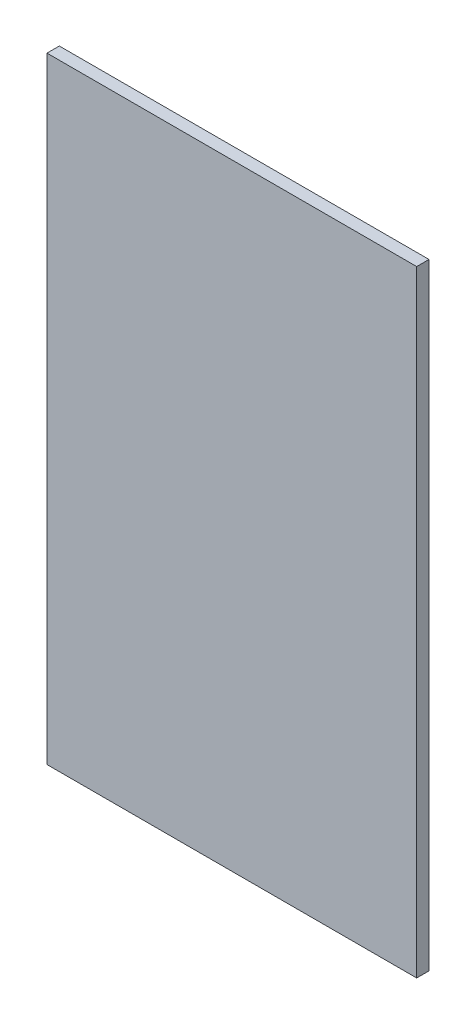
ISO-10303-21;
HEADER;
FILE_DESCRIPTION(('STEP AP214'),'2;1');
FILE_NAME('part.step','',(''),(''),'','','');
FILE_SCHEMA(('AUTOMOTIVE_DESIGN { 1 0 10303 214 1 1 1 1 }'));
ENDSEC;
DATA;
#1=APPLICATION_CONTEXT('core data for automotive mechanical design processes');
#2=APPLICATION_PROTOCOL_DEFINITION('international standard','automotive_design',2000,#1);
#3=PRODUCT_CONTEXT('',#1,'mechanical');
#4=PRODUCT('Part','Part','',(#3));
#5=PRODUCT_RELATED_PRODUCT_CATEGORY('part','',(#4));
#6=PRODUCT_DEFINITION_FORMATION('','',#4);
#7=PRODUCT_DEFINITION_CONTEXT('part definition',#1,'design');
#8=PRODUCT_DEFINITION('design','',#6,#7);
#9=PRODUCT_DEFINITION_SHAPE('','',#8);
#10=(LENGTH_UNIT() NAMED_UNIT(*) SI_UNIT(.MILLI.,.METRE.));
#11=(NAMED_UNIT(*) PLANE_ANGLE_UNIT() SI_UNIT($,.RADIAN.));
#12=(NAMED_UNIT(*) SI_UNIT($,.STERADIAN.) SOLID_ANGLE_UNIT());
#13=UNCERTAINTY_MEASURE_WITH_UNIT(LENGTH_MEASURE(1.E-05),#10,'distance_accuracy_value','');
#14=(GEOMETRIC_REPRESENTATION_CONTEXT(3) GLOBAL_UNCERTAINTY_ASSIGNED_CONTEXT((#13)) GLOBAL_UNIT_ASSIGNED_CONTEXT((#10,
#11,#12)) REPRESENTATION_CONTEXT('',''));
#15=CARTESIAN_POINT('',(0.,0.,0.));
#16=DIRECTION('',(0.,0.,1.));
#17=DIRECTION('',(1.,0.,0.));
#18=AXIS2_PLACEMENT_3D('',#15,#16,#17);
#19=CARTESIAN_POINT('',(0.,1100.09695005203,10.0000000000003));
#20=DIRECTION('',(1.,0.,0.));
#21=DIRECTION('',(0.,0.,-1.));
#22=AXIS2_PLACEMENT_3D('',#19,#20,#21);
#23=PLANE('',#22);
#24=DIRECTION('',(0.,1.,0.));
#25=VECTOR('',#24,1.);
#26=CARTESIAN_POINT('',(0.,1100.09695005203,2.53676555219679E-13));
#27=LINE('',#26,#25);
#28=CARTESIAN_POINT('',(0.,600.096950052034,0.));
#29=VERTEX_POINT('',#28);
#30=CARTESIAN_POINT('',(0.,1100.09695005203,2.53676555219679E-13));
#31=VERTEX_POINT('',#30);
#32=EDGE_CURVE('E95',#29,#31,#27,.T.);
#33=ORIENTED_EDGE('',*,*,#32,.F.);
#34=DIRECTION('',(0.,0.,-1.));
#35=VECTOR('',#34,1.);
#36=CARTESIAN_POINT('',(0.,600.096950052034,10.));
#37=LINE('',#36,#35);
#38=CARTESIAN_POINT('',(0.,600.096950052034,10.));
#39=VERTEX_POINT('',#38);
#40=EDGE_CURVE('E94',#39,#29,#37,.T.);
#41=ORIENTED_EDGE('',*,*,#40,.F.);
#42=DIRECTION('',(0.,1.,0.));
#43=VECTOR('',#42,1.);
#44=CARTESIAN_POINT('',(0.,1100.09695005203,10.0000000000003));
#45=LINE('',#44,#43);
#46=CARTESIAN_POINT('',(0.,1100.09695005203,10.0000000000003));
#47=VERTEX_POINT('',#46);
#48=EDGE_CURVE('E89',#39,#47,#45,.T.);
#49=ORIENTED_EDGE('',*,*,#48,.T.);
#50=DIRECTION('',(0.,0.,-1.));
#51=VECTOR('',#50,1.);
#52=CARTESIAN_POINT('',(0.,1100.09695005203,10.0000000000003));
#53=LINE('',#52,#51);
#54=EDGE_CURVE('E11',#47,#31,#53,.T.);
#55=ORIENTED_EDGE('',*,*,#54,.T.);
#56=EDGE_LOOP('',(#33,#41,#49,#55));
#57=FACE_BOUND('',#56,.T.);
#58=ADVANCED_FACE('F32',(#57),#23,.F.);
#59=CARTESIAN_POINT('',(0.,1100.09695005203,10.0000000000003));
#60=DIRECTION('',(0.,-1.,0.));
#61=DIRECTION('',(0.,0.,1.));
#62=AXIS2_PLACEMENT_3D('',#59,#60,#61);
#63=PLANE('',#62);
#64=DIRECTION('',(1.,0.,0.));
#65=VECTOR('',#64,1.);
#66=CARTESIAN_POINT('',(0.,1100.09695005203,2.53676555219679E-13));
#67=LINE('',#66,#65);
#68=CARTESIAN_POINT('',(300.,1100.09695005203,2.53676555219679E-13));
#69=VERTEX_POINT('',#68);
#70=EDGE_CURVE('E97',#31,#69,#67,.T.);
#71=ORIENTED_EDGE('',*,*,#70,.F.);
#72=ORIENTED_EDGE('',*,*,#54,.F.);
#73=DIRECTION('',(1.,0.,0.));
#74=VECTOR('',#73,1.);
#75=CARTESIAN_POINT('',(0.,1100.09695005203,10.0000000000003));
#76=LINE('',#75,#74);
#77=CARTESIAN_POINT('',(300.,1100.09695005203,10.0000000000003));
#78=VERTEX_POINT('',#77);
#79=EDGE_CURVE('E73',#47,#78,#76,.T.);
#80=ORIENTED_EDGE('',*,*,#79,.T.);
#81=DIRECTION('',(0.,0.,-1.));
#82=VECTOR('',#81,1.);
#83=CARTESIAN_POINT('',(300.,1100.09695005203,10.0000000000003));
#84=LINE('',#83,#82);
#85=EDGE_CURVE('E40',#78,#69,#84,.T.);
#86=ORIENTED_EDGE('',*,*,#85,.T.);
#87=EDGE_LOOP('',(#71,#72,#80,#86));
#88=FACE_BOUND('',#87,.T.);
#89=ADVANCED_FACE('F87',(#88),#63,.F.);
#90=CARTESIAN_POINT('',(300.,1100.09695005203,10.0000000000003));
#91=DIRECTION('',(-1.,0.,0.));
#92=DIRECTION('',(0.,0.,1.));
#93=AXIS2_PLACEMENT_3D('',#90,#91,#92);
#94=PLANE('',#93);
#95=DIRECTION('',(0.,-1.,0.));
#96=VECTOR('',#95,1.);
#97=CARTESIAN_POINT('',(300.,1100.09695005203,2.53676555219679E-13));
#98=LINE('',#97,#96);
#99=CARTESIAN_POINT('',(300.,600.096950052034,0.));
#100=VERTEX_POINT('',#99);
#101=EDGE_CURVE('E83',#69,#100,#98,.T.);
#102=ORIENTED_EDGE('',*,*,#101,.F.);
#103=ORIENTED_EDGE('',*,*,#85,.F.);
#104=DIRECTION('',(0.,-1.,0.));
#105=VECTOR('',#104,1.);
#106=CARTESIAN_POINT('',(300.,1100.09695005203,10.0000000000003));
#107=LINE('',#106,#105);
#108=CARTESIAN_POINT('',(300.,600.096950052034,10.));
#109=VERTEX_POINT('',#108);
#110=EDGE_CURVE('E76',#78,#109,#107,.T.);
#111=ORIENTED_EDGE('',*,*,#110,.T.);
#112=DIRECTION('',(0.,0.,-1.));
#113=VECTOR('',#112,1.);
#114=CARTESIAN_POINT('',(300.,600.096950052034,10.));
#115=LINE('',#114,#113);
#116=EDGE_CURVE('E86',#109,#100,#115,.T.);
#117=ORIENTED_EDGE('',*,*,#116,.T.);
#118=EDGE_LOOP('',(#102,#103,#111,#117));
#119=FACE_BOUND('',#118,.T.);
#120=ADVANCED_FACE('F82',(#119),#94,.F.);
#121=CARTESIAN_POINT('',(0.,600.096950052034,10.));
#122=DIRECTION('',(0.,1.,0.));
#123=DIRECTION('',(0.,0.,-1.));
#124=AXIS2_PLACEMENT_3D('',#121,#122,#123);
#125=PLANE('',#124);
#126=DIRECTION('',(-1.,0.,0.));
#127=VECTOR('',#126,1.);
#128=CARTESIAN_POINT('',(0.,600.096950052034,0.));
#129=LINE('',#128,#127);
#130=EDGE_CURVE('E62',#100,#29,#129,.T.);
#131=ORIENTED_EDGE('',*,*,#130,.F.);
#132=ORIENTED_EDGE('',*,*,#116,.F.);
#133=DIRECTION('',(-1.,0.,0.));
#134=VECTOR('',#133,1.);
#135=CARTESIAN_POINT('',(0.,600.096950052034,10.));
#136=LINE('',#135,#134);
#137=EDGE_CURVE('E48',#109,#39,#136,.T.);
#138=ORIENTED_EDGE('',*,*,#137,.T.);
#139=ORIENTED_EDGE('',*,*,#40,.T.);
#140=EDGE_LOOP('',(#131,#132,#138,#139));
#141=FACE_BOUND('',#140,.T.);
#142=ADVANCED_FACE('F106',(#141),#125,.F.);
#143=CARTESIAN_POINT('',(0.,600.096950052034,10.));
#144=DIRECTION('',(0.,0.,-1.));
#145=DIRECTION('',(-1.,0.,0.));
#146=AXIS2_PLACEMENT_3D('',#143,#144,#145);
#147=PLANE('',#146);
#148=ORIENTED_EDGE('',*,*,#48,.F.);
#149=ORIENTED_EDGE('',*,*,#137,.F.);
#150=ORIENTED_EDGE('',*,*,#110,.F.);
#151=ORIENTED_EDGE('',*,*,#79,.F.);
#152=EDGE_LOOP('',(#148,#149,#150,#151));
#153=FACE_BOUND('',#152,.T.);
#154=ADVANCED_FACE('F78',(#153),#147,.F.);
#155=CARTESIAN_POINT('',(0.,600.096950052034,0.));
#156=DIRECTION('',(0.,0.,-1.));
#157=DIRECTION('',(-1.,0.,0.));
#158=AXIS2_PLACEMENT_3D('',#155,#156,#157);
#159=PLANE('',#158);
#160=ORIENTED_EDGE('',*,*,#32,.T.);
#161=ORIENTED_EDGE('',*,*,#70,.T.);
#162=ORIENTED_EDGE('',*,*,#101,.T.);
#163=ORIENTED_EDGE('',*,*,#130,.T.);
#164=EDGE_LOOP('',(#160,#161,#162,#163));
#165=FACE_BOUND('',#164,.T.);
#166=ADVANCED_FACE('F102',(#165),#159,.T.);
#167=CLOSED_SHELL('',(#58,#89,#120,#142,#154,#166));
#168=MANIFOLD_SOLID_BREP('B2',#167);
#169=ADVANCED_BREP_SHAPE_REPRESENTATION('',(#18,#168),#14);
#170=SHAPE_DEFINITION_REPRESENTATION(#9,#169);
ENDSEC;
END-ISO-10303-21;
